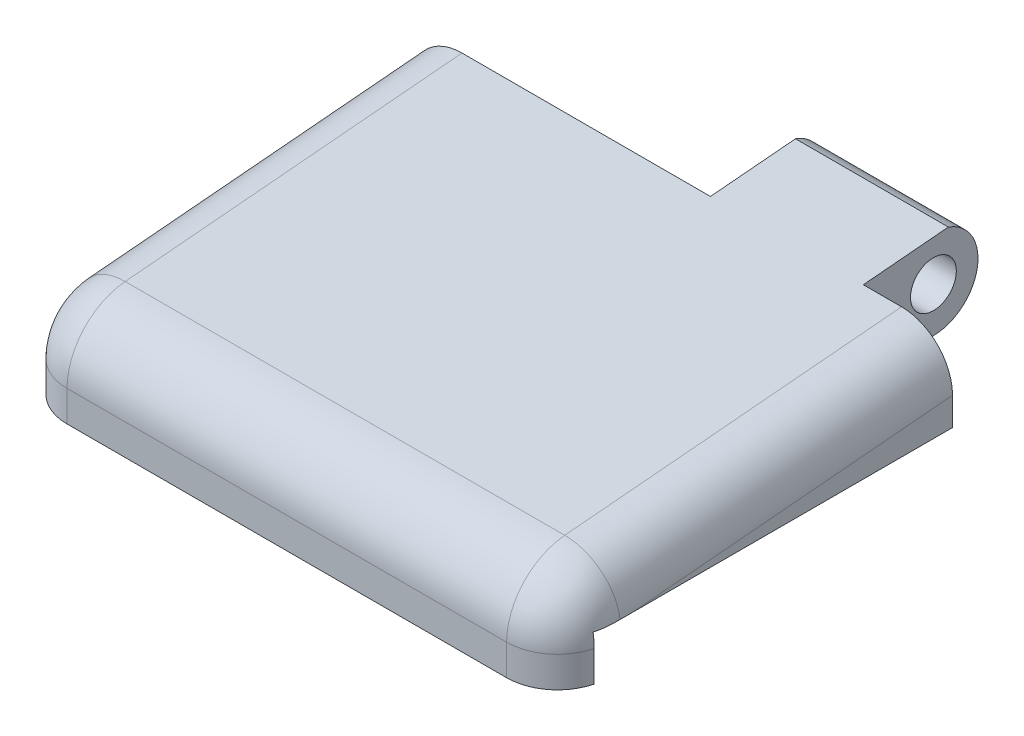
ISO-10303-21;
HEADER;
FILE_DESCRIPTION(('STEP AP214'),'2;1');
FILE_NAME('part.step','',(''),(''),'','','');
FILE_SCHEMA(('AUTOMOTIVE_DESIGN { 1 0 10303 214 1 1 1 1 }'));
ENDSEC;
DATA;
#1=APPLICATION_CONTEXT('core data for automotive mechanical design processes');
#2=APPLICATION_PROTOCOL_DEFINITION('international standard','automotive_design',2000,#1);
#3=PRODUCT_CONTEXT('',#1,'mechanical');
#4=PRODUCT('Part','Part','',(#3));
#5=PRODUCT_RELATED_PRODUCT_CATEGORY('part','',(#4));
#6=PRODUCT_DEFINITION_FORMATION('','',#4);
#7=PRODUCT_DEFINITION_CONTEXT('part definition',#1,'design');
#8=PRODUCT_DEFINITION('design','',#6,#7);
#9=PRODUCT_DEFINITION_SHAPE('','',#8);
#10=(LENGTH_UNIT() NAMED_UNIT(*) SI_UNIT(.MILLI.,.METRE.));
#11=(NAMED_UNIT(*) PLANE_ANGLE_UNIT() SI_UNIT($,.RADIAN.));
#12=(NAMED_UNIT(*) SI_UNIT($,.STERADIAN.) SOLID_ANGLE_UNIT());
#13=UNCERTAINTY_MEASURE_WITH_UNIT(LENGTH_MEASURE(1.E-05),#10,'distance_accuracy_value','');
#14=(GEOMETRIC_REPRESENTATION_CONTEXT(3) GLOBAL_UNCERTAINTY_ASSIGNED_CONTEXT((#13)) GLOBAL_UNIT_ASSIGNED_CONTEXT((#10,
#11,#12)) REPRESENTATION_CONTEXT('',''));
#15=CARTESIAN_POINT('',(0.,0.,0.));
#16=DIRECTION('',(0.,0.,1.));
#17=DIRECTION('',(1.,0.,0.));
#18=AXIS2_PLACEMENT_3D('',#15,#16,#17);
#19=CARTESIAN_POINT('',(0.,0.,0.));
#20=DIRECTION('',(0.,-1.,0.));
#21=DIRECTION('',(0.,0.,-1.));
#22=AXIS2_PLACEMENT_3D('',#19,#20,#21);
#23=PLANE('',#22);
#24=DIRECTION('',(1.,0.,0.));
#25=VECTOR('',#24,1.);
#26=CARTESIAN_POINT('',(-18.8632246376812,0.,11.7160326086957));
#27=LINE('',#26,#25);
#28=CARTESIAN_POINT('',(-18.6550695361003,0.,11.7160326086957));
#29=VERTEX_POINT('',#28);
#30=CARTESIAN_POINT('',(23.428620260738,0.,11.7160326086957));
#31=VERTEX_POINT('',#30);
#32=EDGE_CURVE('E353',#29,#31,#27,.T.);
#33=ORIENTED_EDGE('',*,*,#32,.F.);
#34=CARTESIAN_POINT('',(-18.8623143311757,0.,9.81062556264592));
#35=CARTESIAN_POINT('',(-18.8622212720629,0.,9.85615641249188));
#36=CARTESIAN_POINT('',(-18.8620788523589,0.,9.90168713850057));
#37=CARTESIAN_POINT('',(-18.8615798443658,0.,9.99275023400727));
#38=CARTESIAN_POINT('',(-18.8612232424007,0.,10.0382826034246));
#39=CARTESIAN_POINT('',(-18.8596582465762,0.,10.1749408688543));
#40=CARTESIAN_POINT('',(-18.8579544669418,0.,10.2660633373014));
#41=CARTESIAN_POINT('',(-18.8520022643299,0.,10.4471469945741));
#42=CARTESIAN_POINT('',(-18.8477845150658,0.,10.537109039549));
#43=CARTESIAN_POINT('',(-18.8357464956938,0.,10.7167911956804));
#44=CARTESIAN_POINT('',(-18.8279265504596,0.,10.8065113279208));
#45=CARTESIAN_POINT('',(-18.8035019626792,0.,11.0246343076007));
#46=CARTESIAN_POINT('',(-18.7845509662702,0.,11.1527912263999));
#47=CARTESIAN_POINT('',(-18.7361772906335,0.,11.4071250639296));
#48=CARTESIAN_POINT('',(-18.7067553021801,0.,11.5333021126996));
#49=CARTESIAN_POINT('',(-18.6362631751471,0.,11.784627061321));
#50=CARTESIAN_POINT('',(-18.5950108878518,0.,11.9097246134625));
#51=CARTESIAN_POINT('',(-18.5244396704684,0.,12.0941096265706));
#52=CARTESIAN_POINT('',(-18.4994417229986,0.,12.1550790979152));
#53=CARTESIAN_POINT('',(-18.4465652663742,0.,12.2757633399427));
#54=CARTESIAN_POINT('',(-18.4186864481418,0.,12.3354779751703));
#55=CARTESIAN_POINT('',(-18.3893766079648,0.,12.3944945425097));
#56=B_SPLINE_CURVE_WITH_KNOTS('',3,(#34,#35,#36,#37,#38,#39,#40,#41,#42,#43,#44,#45,#46,#47,#48,
#49,#50,#51,#52,#53,#54,#55),.UNSPECIFIED.,.F.,.F.,(4,2,2,2,2,2,2,2,2,2,4),(0.,
0.136592530811276,0.273193784304992,0.546590036837258,0.816716886009464,1.08681937785008,
1.47506879685177,1.86329260767091,2.25784813489281,2.45546827625955,2.6531096416016),.UNSPECIFIED.);
#57=CARTESIAN_POINT('',(-18.8623143311757,0.,9.81062556264592));
#58=VERTEX_POINT('',#57);
#59=EDGE_CURVE('E276',#29,#58,#56,.F.);
#60=ORIENTED_EDGE('',*,*,#59,.T.);
#61=CARTESIAN_POINT('',(-14.8632246376812,0.,8.83154574534277));
#62=DIRECTION('',(0.,-1.,0.));
#63=DIRECTION('',(0.,0.,-1.));
#64=AXIS2_PLACEMENT_3D('',#61,#62,#63);
#65=ELLIPSE('',#64,45.8948529826757,4.);
#66=CARTESIAN_POINT('',(-18.8632246376812,0.,8.83154574534276));
#67=VERTEX_POINT('',#66);
#68=EDGE_CURVE('E166',#58,#67,#65,.T.);
#69=ORIENTED_EDGE('',*,*,#68,.T.);
#70=DIRECTION('',(0.,0.,1.));
#71=VECTOR('',#70,1.);
#72=CARTESIAN_POINT('',(-18.8632246376812,0.,-16.2839673913044));
#73=LINE('',#72,#71);
#74=CARTESIAN_POINT('',(-18.8632246376812,0.,-16.2839673913044));
#75=VERTEX_POINT('',#74);
#76=EDGE_CURVE('E151',#75,#67,#73,.T.);
#77=ORIENTED_EDGE('',*,*,#76,.F.);
#78=DIRECTION('',(-1.,0.,0.));
#79=VECTOR('',#78,1.);
#80=CARTESIAN_POINT('',(-18.8632246376812,0.,-16.2839673913044));
#81=LINE('',#80,#79);
#82=CARTESIAN_POINT('',(4.63677536231884,0.,-16.2839673913044));
#83=VERTEX_POINT('',#82);
#84=EDGE_CURVE('E164',#83,#75,#81,.T.);
#85=ORIENTED_EDGE('',*,*,#84,.F.);
#86=DIRECTION('',(0.,0.,1.));
#87=VECTOR('',#86,1.);
#88=CARTESIAN_POINT('',(4.63677536231884,0.,-25.2839673913043));
#89=LINE('',#88,#87);
#90=CARTESIAN_POINT('',(4.63677536231884,0.,-21.7839673913043));
#91=VERTEX_POINT('',#90);
#92=EDGE_CURVE('E188',#91,#83,#89,.T.);
#93=ORIENTED_EDGE('',*,*,#92,.F.);
#94=DIRECTION('',(-1.,0.,0.));
#95=VECTOR('',#94,1.);
#96=CARTESIAN_POINT('',(16.6367753623188,0.,-21.7839673913043));
#97=LINE('',#96,#95);
#98=CARTESIAN_POINT('',(16.6367753623188,0.,-21.7839673913043));
#99=VERTEX_POINT('',#98);
#100=EDGE_CURVE('E197',#91,#99,#97,.F.);
#101=ORIENTED_EDGE('',*,*,#100,.T.);
#102=DIRECTION('',(0.,0.,-1.));
#103=VECTOR('',#102,1.);
#104=CARTESIAN_POINT('',(16.6367753623188,0.,-16.2839673913044));
#105=LINE('',#104,#103);
#106=CARTESIAN_POINT('',(16.6367753623188,0.,-16.2839673913044));
#107=VERTEX_POINT('',#106);
#108=EDGE_CURVE('E185',#107,#99,#105,.T.);
#109=ORIENTED_EDGE('',*,*,#108,.F.);
#110=DIRECTION('',(-1.,0.,0.));
#111=VECTOR('',#110,1.);
#112=CARTESIAN_POINT('',(16.6367753623188,0.,-16.2839673913044));
#113=LINE('',#112,#111);
#114=CARTESIAN_POINT('',(23.6367753623188,0.,-16.2839673913044));
#115=VERTEX_POINT('',#114);
#116=EDGE_CURVE('E182',#115,#107,#113,.T.);
#117=ORIENTED_EDGE('',*,*,#116,.F.);
#118=DIRECTION('',(0.,0.,-1.));
#119=VECTOR('',#118,1.);
#120=CARTESIAN_POINT('',(23.6367753623188,0.,-16.2839673913044));
#121=LINE('',#120,#119);
#122=CARTESIAN_POINT('',(23.6367753623188,0.,8.83154574534272));
#123=VERTEX_POINT('',#122);
#124=EDGE_CURVE('E167',#123,#115,#121,.T.);
#125=ORIENTED_EDGE('',*,*,#124,.F.);
#126=CARTESIAN_POINT('',(19.6367753623188,0.,8.83154574534277));
#127=DIRECTION('',(0.,-1.,0.));
#128=DIRECTION('',(0.,0.,1.));
#129=AXIS2_PLACEMENT_3D('',#126,#127,#128);
#130=ELLIPSE('',#129,45.8948529826757,4.);
#131=CARTESIAN_POINT('',(23.6358650558134,0.,9.81062556264591));
#132=VERTEX_POINT('',#131);
#133=EDGE_CURVE('E389',#123,#132,#130,.T.);
#134=ORIENTED_EDGE('',*,*,#133,.T.);
#135=CARTESIAN_POINT('',(23.6358650558134,0.,9.81062556264591));
#136=CARTESIAN_POINT('',(23.6357719967006,0.,9.85615641249186));
#137=CARTESIAN_POINT('',(23.6356295769966,0.,9.90168713850055));
#138=CARTESIAN_POINT('',(23.6351305690035,0.,9.99275023400725));
#139=CARTESIAN_POINT('',(23.6347739670384,0.,10.0382826034245));
#140=CARTESIAN_POINT('',(23.6332089712139,0.,10.1749408688542));
#141=CARTESIAN_POINT('',(23.6315051915795,0.,10.2660633373014));
#142=CARTESIAN_POINT('',(23.6255529889675,0.,10.4471469945741));
#143=CARTESIAN_POINT('',(23.6213352397034,0.,10.537109039549));
#144=CARTESIAN_POINT('',(23.6092972203315,0.,10.7167911956804));
#145=CARTESIAN_POINT('',(23.6014772750972,0.,10.8065113279208));
#146=CARTESIAN_POINT('',(23.5770526873169,0.,11.0246343076007));
#147=CARTESIAN_POINT('',(23.5581016909079,0.,11.1527912263998));
#148=CARTESIAN_POINT('',(23.5097280152711,0.,11.4071250639296));
#149=CARTESIAN_POINT('',(23.4803060268178,0.,11.5333021126996));
#150=CARTESIAN_POINT('',(23.4098138997848,0.,11.784627061321));
#151=CARTESIAN_POINT('',(23.3685616124895,0.,11.9097246134625));
#152=CARTESIAN_POINT('',(23.2979903951061,0.,12.0941096265706));
#153=CARTESIAN_POINT('',(23.2729924476363,0.,12.1550790979152));
#154=CARTESIAN_POINT('',(23.2201159910119,0.,12.2757633399427));
#155=CARTESIAN_POINT('',(23.1922371727795,0.,12.3354779751703));
#156=CARTESIAN_POINT('',(23.1629273326025,0.,12.3944945425097));
#157=B_SPLINE_CURVE_WITH_KNOTS('',3,(#135,#136,#137,#138,#139,#140,#141,#142,#143,#144,#145,
#146,#147,#148,#149,#150,#151,#152,#153,#154,#155,#156),.UNSPECIFIED.,.F.,.F.,(4,2,2,2,2,2,2,2,
2,2,4),(0.,0.136592530811274,0.273193784304992,0.54659003683726,0.816716886009464,
1.08681937785008,1.47506879685177,1.86329260767091,2.25784813489281,2.45546827625956,
2.65310964160161),.UNSPECIFIED.);
#158=EDGE_CURVE('E258',#132,#31,#157,.T.);
#159=ORIENTED_EDGE('',*,*,#158,.T.);
#160=EDGE_LOOP('',(#33,#60,#69,#77,#85,#93,#101,#109,#117,#125,#134,#159));
#161=FACE_BOUND('',#160,.T.);
#162=ADVANCED_FACE('F33',(#161),#23,.T.);
#163=CARTESIAN_POINT('',(-18.8632246376812,7.,-16.2839673913044));
#164=DIRECTION('',(0.,0.,1.));
#165=DIRECTION('',(1.,0.,0.));
#166=AXIS2_PLACEMENT_3D('',#163,#164,#165);
#167=PLANE('',#166);
#168=DIRECTION('',(0.,-1.,0.));
#169=VECTOR('',#168,1.);
#170=CARTESIAN_POINT('',(-18.8632246376812,7.,-16.2839673913044));
#171=LINE('',#170,#169);
#172=CARTESIAN_POINT('',(-18.8632246376812,2.19732267809322,-16.2839673913044));
#173=VERTEX_POINT('',#172);
#174=EDGE_CURVE('E148',#173,#75,#171,.T.);
#175=ORIENTED_EDGE('',*,*,#174,.F.);
#176=CARTESIAN_POINT('',(-14.8632246376812,2.19732267809323,-16.2839673913044));
#177=DIRECTION('',(0.,0.,1.));
#178=DIRECTION('',(0.,1.,0.));
#179=AXIS2_PLACEMENT_3D('',#176,#177,#178);
#180=ELLIPSE('',#179,4.01527935017339,4.);
#181=CARTESIAN_POINT('',(-14.8632246376812,6.21260202826662,-16.2839673913044));
#182=VERTEX_POINT('',#181);
#183=EDGE_CURVE('E330',#173,#182,#180,.F.);
#184=ORIENTED_EDGE('',*,*,#183,.T.);
#185=DIRECTION('',(-1.,0.,0.));
#186=VECTOR('',#185,1.);
#187=CARTESIAN_POINT('',(0.,6.21260202826662,-16.2839673913044));
#188=LINE('',#187,#186);
#189=CARTESIAN_POINT('',(4.63677536231884,6.21260202826662,-16.2839673913044));
#190=VERTEX_POINT('',#189);
#191=EDGE_CURVE('E216',#182,#190,#188,.F.);
#192=ORIENTED_EDGE('',*,*,#191,.T.);
#193=DIRECTION('',(0.,-1.,0.));
#194=VECTOR('',#193,1.);
#195=CARTESIAN_POINT('',(4.63677536231884,7.,-16.2839673913044));
#196=LINE('',#195,#194);
#197=EDGE_CURVE('E171',#190,#83,#196,.T.);
#198=ORIENTED_EDGE('',*,*,#197,.T.);
#199=ORIENTED_EDGE('',*,*,#84,.T.);
#200=EDGE_LOOP('',(#175,#184,#192,#198,#199));
#201=FACE_BOUND('',#200,.T.);
#202=ADVANCED_FACE('F169',(#201),#167,.F.);
#203=CARTESIAN_POINT('',(-18.8632246376812,7.,-16.2839673913044));
#204=DIRECTION('',(1.,0.,0.));
#205=DIRECTION('',(0.,0.,-1.));
#206=AXIS2_PLACEMENT_3D('',#203,#204,#205);
#207=PLANE('',#206);
#208=ORIENTED_EDGE('',*,*,#76,.T.);
#209=DIRECTION('',(0.,-0.0871557427476653,0.996194698091745));
#210=VECTOR('',#209,1.);
#211=CARTESIAN_POINT('',(-18.8632246376812,2.22782323589964,-16.632590362295));
#212=LINE('',#211,#210);
#213=EDGE_CURVE('E153',#67,#173,#212,.F.);
#214=ORIENTED_EDGE('',*,*,#213,.T.);
#215=ORIENTED_EDGE('',*,*,#174,.T.);
#216=EDGE_LOOP('',(#208,#214,#215));
#217=FACE_BOUND('',#216,.T.);
#218=ADVANCED_FACE('F150',(#217),#207,.F.);
#219=CARTESIAN_POINT('',(-18.8632246376812,7.,14.7160326086957));
#220=DIRECTION('',(0.,0.,-1.));
#221=DIRECTION('',(-1.,0.,0.));
#222=AXIS2_PLACEMENT_3D('',#219,#220,#221);
#223=PLANE('',#222);
#224=DIRECTION('',(1.,0.,0.));
#225=VECTOR('',#224,1.);
#226=CARTESIAN_POINT('',(-18.8632246376812,-1.08120241112434,14.7160326086957));
#227=LINE('',#226,#225);
#228=CARTESIAN_POINT('',(19.6367753623188,-1.08120241112434,14.7160326086957));
#229=VERTEX_POINT('',#228);
#230=CARTESIAN_POINT('',(-14.8632246376812,-1.08120241112434,14.7160326086957));
#231=VERTEX_POINT('',#230);
#232=EDGE_CURVE('E220',#229,#231,#227,.F.);
#233=ORIENTED_EDGE('',*,*,#232,.T.);
#234=DIRECTION('',(0.,-1.,0.));
#235=VECTOR('',#234,1.);
#236=CARTESIAN_POINT('',(-14.8632246376812,7.,14.7160326086957));
#237=LINE('',#236,#235);
#238=CARTESIAN_POINT('',(-14.8632246376812,-3.5,14.7160326086957));
#239=VERTEX_POINT('',#238);
#240=EDGE_CURVE('E50',#231,#239,#237,.T.);
#241=ORIENTED_EDGE('',*,*,#240,.T.);
#242=DIRECTION('',(-1.,0.,0.));
#243=VECTOR('',#242,1.);
#244=CARTESIAN_POINT('',(-18.8632246376812,-3.5,14.7160326086957));
#245=LINE('',#244,#243);
#246=CARTESIAN_POINT('',(19.6367753623188,-3.5,14.7160326086957));
#247=VERTEX_POINT('',#246);
#248=EDGE_CURVE('E209',#247,#239,#245,.T.);
#249=ORIENTED_EDGE('',*,*,#248,.F.);
#250=DIRECTION('',(0.,-1.,0.));
#251=VECTOR('',#250,1.);
#252=CARTESIAN_POINT('',(19.6367753623188,7.,14.7160326086957));
#253=LINE('',#252,#251);
#254=EDGE_CURVE('E346',#247,#229,#253,.F.);
#255=ORIENTED_EDGE('',*,*,#254,.T.);
#256=EDGE_LOOP('',(#233,#241,#249,#255));
#257=FACE_BOUND('',#256,.T.);
#258=ADVANCED_FACE('F303',(#257),#223,.F.);
#259=CARTESIAN_POINT('',(23.6367753623188,7.,-16.2839673913044));
#260=DIRECTION('',(-1.,0.,0.));
#261=DIRECTION('',(0.,0.,1.));
#262=AXIS2_PLACEMENT_3D('',#259,#260,#261);
#263=PLANE('',#262);
#264=DIRECTION('',(0.,-1.,0.));
#265=VECTOR('',#264,1.);
#266=CARTESIAN_POINT('',(23.6367753623188,7.,-16.2839673913044));
#267=LINE('',#266,#265);
#268=CARTESIAN_POINT('',(23.6367753623188,2.19732267809322,-16.2839673913044));
#269=VERTEX_POINT('',#268);
#270=EDGE_CURVE('E158',#269,#115,#267,.T.);
#271=ORIENTED_EDGE('',*,*,#270,.F.);
#272=DIRECTION('',(0.,0.0871557427476653,-0.996194698091745));
#273=VECTOR('',#272,1.);
#274=CARTESIAN_POINT('',(23.6367753623188,-0.0850077130325898,9.80318835144331));
#275=LINE('',#274,#273);
#276=EDGE_CURVE('E341',#269,#123,#275,.F.);
#277=ORIENTED_EDGE('',*,*,#276,.T.);
#278=ORIENTED_EDGE('',*,*,#124,.T.);
#279=EDGE_LOOP('',(#271,#277,#278));
#280=FACE_BOUND('',#279,.T.);
#281=ADVANCED_FACE('F299',(#280),#263,.F.);
#282=CARTESIAN_POINT('',(16.6367753623188,7.,-16.2839673913044));
#283=DIRECTION('',(0.,0.,1.));
#284=DIRECTION('',(1.,0.,0.));
#285=AXIS2_PLACEMENT_3D('',#282,#283,#284);
#286=PLANE('',#285);
#287=DIRECTION('',(-1.,0.,0.));
#288=VECTOR('',#287,1.);
#289=CARTESIAN_POINT('',(0.,6.21260202826662,-16.2839673913044));
#290=LINE('',#289,#288);
#291=CARTESIAN_POINT('',(16.6367753623188,6.21260202826662,-16.2839673913044));
#292=VERTEX_POINT('',#291);
#293=CARTESIAN_POINT('',(19.6367753623188,6.21260202826662,-16.2839673913044));
#294=VERTEX_POINT('',#293);
#295=EDGE_CURVE('E213',#292,#294,#290,.F.);
#296=ORIENTED_EDGE('',*,*,#295,.T.);
#297=CARTESIAN_POINT('',(19.6367753623188,2.19732267809323,-16.2839673913044));
#298=DIRECTION('',(0.,0.,1.));
#299=DIRECTION('',(0.,-1.,0.));
#300=AXIS2_PLACEMENT_3D('',#297,#298,#299);
#301=ELLIPSE('',#300,4.01527935017339,4.);
#302=EDGE_CURVE('E344',#294,#269,#301,.F.);
#303=ORIENTED_EDGE('',*,*,#302,.T.);
#304=ORIENTED_EDGE('',*,*,#270,.T.);
#305=ORIENTED_EDGE('',*,*,#116,.T.);
#306=DIRECTION('',(0.,-1.,0.));
#307=VECTOR('',#306,1.);
#308=CARTESIAN_POINT('',(16.6367753623188,7.,-16.2839673913044));
#309=LINE('',#308,#307);
#310=EDGE_CURVE('E191',#292,#107,#309,.T.);
#311=ORIENTED_EDGE('',*,*,#310,.F.);
#312=EDGE_LOOP('',(#296,#303,#304,#305,#311));
#313=FACE_BOUND('',#312,.T.);
#314=ADVANCED_FACE('F295',(#313),#286,.F.);
#315=CARTESIAN_POINT('',(16.6367753623188,7.,-16.2839673913044));
#316=DIRECTION('',(-1.,0.,0.));
#317=DIRECTION('',(0.,0.,1.));
#318=AXIS2_PLACEMENT_3D('',#315,#316,#317);
#319=PLANE('',#318);
#320=CARTESIAN_POINT('',(16.6367753623188,3.5,-21.7839673913043));
#321=DIRECTION('',(1.,0.,0.));
#322=DIRECTION('',(0.,0.,-1.));
#323=AXIS2_PLACEMENT_3D('',#320,#321,#322);
#324=CIRCLE('',#323,1.8);
#325=CARTESIAN_POINT('',(16.6367753623188,3.5,-23.5839673913043));
#326=VERTEX_POINT('',#325);
#327=EDGE_CURVE('E176',#326,#326,#324,.T.);
#328=ORIENTED_EDGE('',*,*,#327,.F.);
#329=EDGE_LOOP('',(#328));
#330=FACE_BOUND('',#329,.T.);
#331=CARTESIAN_POINT('',(16.6367753623188,3.5,-21.7839673913043));
#332=DIRECTION('',(-1.,0.,0.));
#333=DIRECTION('',(0.,0.,1.));
#334=AXIS2_PLACEMENT_3D('',#331,#332,#333);
#335=CIRCLE('',#334,3.5);
#336=CARTESIAN_POINT('',(16.6367753623188,3.5,-25.2839673913043));
#337=VERTEX_POINT('',#336);
#338=CARTESIAN_POINT('',(16.6367753623188,6.79664494933587,-22.9596085261828));
#339=VERTEX_POINT('',#338);
#340=EDGE_CURVE('E200',#337,#339,#335,.F.);
#341=ORIENTED_EDGE('',*,*,#340,.T.);
#342=DIRECTION('',(0.,0.0871557427476653,-0.996194698091745));
#343=VECTOR('',#342,1.);
#344=CARTESIAN_POINT('',(16.6367753623188,7.,-25.2839673913044));
#345=LINE('',#344,#343);
#346=EDGE_CURVE('E211',#339,#292,#345,.F.);
#347=ORIENTED_EDGE('',*,*,#346,.T.);
#348=ORIENTED_EDGE('',*,*,#310,.T.);
#349=ORIENTED_EDGE('',*,*,#108,.T.);
#350=CARTESIAN_POINT('',(16.6367753623188,3.5,-21.7839673913043));
#351=DIRECTION('',(-1.,0.,0.));
#352=DIRECTION('',(0.,0.,1.));
#353=AXIS2_PLACEMENT_3D('',#350,#351,#352);
#354=CIRCLE('',#353,3.5);
#355=EDGE_CURVE('E203',#99,#337,#354,.F.);
#356=ORIENTED_EDGE('',*,*,#355,.T.);
#357=EDGE_LOOP('',(#341,#347,#348,#349,#356));
#358=FACE_BOUND('',#357,.T.);
#359=ADVANCED_FACE('F291',(#330,#358),#319,.F.);
#360=CARTESIAN_POINT('',(4.63677536231884,7.,-25.2839673913043));
#361=DIRECTION('',(1.,0.,0.));
#362=DIRECTION('',(0.,0.,-1.));
#363=AXIS2_PLACEMENT_3D('',#360,#361,#362);
#364=PLANE('',#363);
#365=CARTESIAN_POINT('',(4.63677536231884,3.5,-21.7839673913043));
#366=DIRECTION('',(1.,0.,0.));
#367=DIRECTION('',(0.,0.,-1.));
#368=AXIS2_PLACEMENT_3D('',#365,#366,#367);
#369=CIRCLE('',#368,1.8);
#370=CARTESIAN_POINT('',(4.63677536231884,3.5,-23.5839673913043));
#371=VERTEX_POINT('',#370);
#372=EDGE_CURVE('E173',#371,#371,#369,.F.);
#373=ORIENTED_EDGE('',*,*,#372,.F.);
#374=EDGE_LOOP('',(#373));
#375=FACE_BOUND('',#374,.T.);
#376=ORIENTED_EDGE('',*,*,#197,.F.);
#377=DIRECTION('',(0.,-0.0871557427476653,0.996194698091745));
#378=VECTOR('',#377,1.);
#379=CARTESIAN_POINT('',(4.63677536231884,7.,-25.2839673913044));
#380=LINE('',#379,#378);
#381=CARTESIAN_POINT('',(4.63677536231884,6.79664494933587,-22.9596085261828));
#382=VERTEX_POINT('',#381);
#383=EDGE_CURVE('E218',#190,#382,#380,.F.);
#384=ORIENTED_EDGE('',*,*,#383,.T.);
#385=CARTESIAN_POINT('',(4.63677536231884,3.5,-21.7839673913043));
#386=DIRECTION('',(1.,0.,0.));
#387=DIRECTION('',(0.,0.,-1.));
#388=AXIS2_PLACEMENT_3D('',#385,#386,#387);
#389=CIRCLE('',#388,3.5);
#390=CARTESIAN_POINT('',(4.63677536231884,3.5,-25.2839673913043));
#391=VERTEX_POINT('',#390);
#392=EDGE_CURVE('E157',#382,#391,#389,.F.);
#393=ORIENTED_EDGE('',*,*,#392,.T.);
#394=CARTESIAN_POINT('',(4.63677536231884,3.5,-21.7839673913043));
#395=DIRECTION('',(1.,0.,0.));
#396=DIRECTION('',(0.,0.,-1.));
#397=AXIS2_PLACEMENT_3D('',#394,#395,#396);
#398=CIRCLE('',#397,3.5);
#399=EDGE_CURVE('E195',#391,#91,#398,.F.);
#400=ORIENTED_EDGE('',*,*,#399,.T.);
#401=ORIENTED_EDGE('',*,*,#92,.T.);
#402=EDGE_LOOP('',(#376,#384,#393,#400,#401));
#403=FACE_BOUND('',#402,.T.);
#404=ADVANCED_FACE('F287',(#375,#403),#364,.F.);
#405=CARTESIAN_POINT('',(-0.454393462224301,3.5,-21.7839673913043));
#406=DIRECTION('',(1.,0.,0.));
#407=DIRECTION('',(0.,0.,-1.));
#408=AXIS2_PLACEMENT_3D('',#405,#406,#407);
#409=CYLINDRICAL_SURFACE('',#408,1.8);
#410=ORIENTED_EDGE('',*,*,#372,.T.);
#411=EDGE_LOOP('',(#410));
#412=FACE_BOUND('',#411,.T.);
#413=ORIENTED_EDGE('',*,*,#327,.T.);
#414=EDGE_LOOP('',(#413));
#415=FACE_BOUND('',#414,.T.);
#416=ADVANCED_FACE('F247',(#412,#415),#409,.F.);
#417=CARTESIAN_POINT('',(0.,3.5,-21.7839673913043));
#418=DIRECTION('',(-1.,0.,0.));
#419=DIRECTION('',(0.,0.,1.));
#420=AXIS2_PLACEMENT_3D('',#417,#418,#419);
#421=CYLINDRICAL_SURFACE('',#420,3.5);
#422=ORIENTED_EDGE('',*,*,#392,.F.);
#423=DIRECTION('',(-1.,0.,0.));
#424=VECTOR('',#423,1.);
#425=CARTESIAN_POINT('',(10.6367753623188,6.79664494933587,-22.9596085261828));
#426=LINE('',#425,#424);
#427=EDGE_CURVE('E205',#382,#339,#426,.F.);
#428=ORIENTED_EDGE('',*,*,#427,.T.);
#429=ORIENTED_EDGE('',*,*,#340,.F.);
#430=DIRECTION('',(-1.,0.,0.));
#431=VECTOR('',#430,1.);
#432=CARTESIAN_POINT('',(16.6367753623188,3.5,-25.2839673913043));
#433=LINE('',#432,#431);
#434=EDGE_CURVE('E206',#391,#337,#433,.F.);
#435=ORIENTED_EDGE('',*,*,#434,.F.);
#436=EDGE_LOOP('',(#422,#428,#429,#435));
#437=FACE_BOUND('',#436,.T.);
#438=ADVANCED_FACE('F314',(#437),#421,.T.);
#439=CARTESIAN_POINT('',(16.6367753623188,3.5,-21.7839673913043));
#440=DIRECTION('',(1.,0.,0.));
#441=DIRECTION('',(0.,0.,-1.));
#442=AXIS2_PLACEMENT_3D('',#439,#440,#441);
#443=CYLINDRICAL_SURFACE('',#442,3.5);
#444=ORIENTED_EDGE('',*,*,#355,.F.);
#445=ORIENTED_EDGE('',*,*,#100,.F.);
#446=ORIENTED_EDGE('',*,*,#399,.F.);
#447=ORIENTED_EDGE('',*,*,#434,.T.);
#448=EDGE_LOOP('',(#444,#445,#446,#447));
#449=FACE_BOUND('',#448,.T.);
#450=ADVANCED_FACE('F311',(#449),#443,.T.);
#451=CARTESIAN_POINT('',(0.,7.,-25.2839673913044));
#452=DIRECTION('',(0.,-0.996194698091745,-0.0871557427476653));
#453=DIRECTION('',(1.,0.,0.));
#454=AXIS2_PLACEMENT_3D('',#451,#452,#453);
#455=PLANE('',#454);
#456=ORIENTED_EDGE('',*,*,#191,.F.);
#457=DIRECTION('',(0.,0.0871557427476653,-0.996194698091745));
#458=VECTOR('',#457,1.);
#459=CARTESIAN_POINT('',(-14.8632246376812,3.89977107933439,10.151811322434));
#460=LINE('',#459,#458);
#461=CARTESIAN_POINT('',(-14.8632246376812,3.89977107933439,10.151811322434));
#462=VERTEX_POINT('',#461);
#463=EDGE_CURVE('E325',#182,#462,#460,.F.);
#464=ORIENTED_EDGE('',*,*,#463,.T.);
#465=DIRECTION('',(-1.,0.,0.));
#466=VECTOR('',#465,1.);
#467=CARTESIAN_POINT('',(23.6367753623188,3.89977107933439,10.151811322434));
#468=LINE('',#467,#466);
#469=CARTESIAN_POINT('',(19.6367753623188,3.89977107933439,10.151811322434));
#470=VERTEX_POINT('',#469);
#471=EDGE_CURVE('E222',#462,#470,#468,.F.);
#472=ORIENTED_EDGE('',*,*,#471,.T.);
#473=DIRECTION('',(0.,-0.0871557427476653,0.996194698091745));
#474=VECTOR('',#473,1.);
#475=CARTESIAN_POINT('',(19.6367753623188,6.21260202826662,-16.2839673913044));
#476=LINE('',#475,#474);
#477=EDGE_CURVE('E334',#470,#294,#476,.F.);
#478=ORIENTED_EDGE('',*,*,#477,.T.);
#479=ORIENTED_EDGE('',*,*,#295,.F.);
#480=ORIENTED_EDGE('',*,*,#346,.F.);
#481=ORIENTED_EDGE('',*,*,#427,.F.);
#482=ORIENTED_EDGE('',*,*,#383,.F.);
#483=EDGE_LOOP('',(#456,#464,#472,#478,#479,#480,#481,#482));
#484=FACE_BOUND('',#483,.T.);
#485=ADVANCED_FACE('F245',(#484),#455,.F.);
#486=CARTESIAN_POINT('',(-18.8632246376812,-3.5,11.7160326086957));
#487=DIRECTION('',(0.,0.,1.));
#488=DIRECTION('',(1.,0.,0.));
#489=AXIS2_PLACEMENT_3D('',#486,#487,#488);
#490=PLANE('',#489);
#491=DIRECTION('',(0.,-1.,0.));
#492=VECTOR('',#491,1.);
#493=CARTESIAN_POINT('',(-18.7362079838886,7.,11.7160326086957));
#494=LINE('',#493,#492);
#495=CARTESIAN_POINT('',(-18.7362079838886,-3.5,11.7160326086957));
#496=VERTEX_POINT('',#495);
#497=CARTESIAN_POINT('',(-18.7362079838886,-1.08120241112434,11.7160326086957));
#498=VERTEX_POINT('',#497);
#499=EDGE_CURVE('E234',#496,#498,#494,.F.);
#500=ORIENTED_EDGE('',*,*,#499,.T.);
#501=CARTESIAN_POINT('',(-18.6550695361003,0.,11.7160326086957));
#502=CARTESIAN_POINT('',(-18.6704331192507,-0.0962520591327507,11.7160326086957));
#503=CARTESIAN_POINT('',(-18.6833616740046,-0.192868642369853,11.7160326086957));
#504=CARTESIAN_POINT('',(-18.7047800401528,-0.386554709642636,11.7160326086957));
#505=CARTESIAN_POINT('',(-18.713271726511,-0.483623984851359,11.7160326086957));
#506=CARTESIAN_POINT('',(-18.7262175333451,-0.677386589734707,11.7160326086957));
#507=CARTESIAN_POINT('',(-18.7306976491903,-0.774078236993188,11.7160326086957));
#508=CARTESIAN_POINT('',(-18.7359869234096,-0.96757949664846,11.7160326086957));
#509=CARTESIAN_POINT('',(-18.73679535988,-1.06438912850036,11.7160326086957));
#510=CARTESIAN_POINT('',(-18.734794112469,-1.25800454106717,11.7160326086957));
#511=CARTESIAN_POINT('',(-18.7319832071572,-1.35481030945085,11.7160326086957));
#512=CARTESIAN_POINT('',(-18.7225594423474,-1.54821809414566,11.7160326086957));
#513=CARTESIAN_POINT('',(-18.7159474254708,-1.64482015085318,11.7160326086957));
#514=CARTESIAN_POINT('',(-18.6984998375585,-1.83829018088646,11.7160326086957));
#515=CARTESIAN_POINT('',(-18.6876368753127,-1.93515574893393,11.7160326086957));
#516=CARTESIAN_POINT('',(-18.6612195153075,-2.12829570219212,11.7160326086957));
#517=CARTESIAN_POINT('',(-18.6456625189336,-2.22456972972604,11.7160326086957));
#518=CARTESIAN_POINT('',(-18.627529107008,-2.32038378714686,11.7160326086957));
#519=B_SPLINE_CURVE_WITH_KNOTS('',3,(#501,#502,#503,#504,#505,#506,#507,#508,#509,#510,#511,
#512,#513,#514,#515,#516,#517,#518),.UNSPECIFIED.,.F.,.F.,(4,2,2,2,2,2,2,2,4),(0.,
0.292345692325822,0.584567742978317,0.874882167299401,1.16525366904641,1.45572318904156,
1.74612834325252,2.03843639549149,2.33090656712731),.UNSPECIFIED.);
#520=EDGE_CURVE('E250',#498,#29,#519,.F.);
#521=ORIENTED_EDGE('',*,*,#520,.T.);
#522=ORIENTED_EDGE('',*,*,#32,.T.);
#523=CARTESIAN_POINT('',(23.428620260738,0.,11.7160326086957));
#524=CARTESIAN_POINT('',(23.4439838438884,-0.0962520591327507,11.7160326086957));
#525=CARTESIAN_POINT('',(23.4569123986423,-0.192868642369853,11.7160326086957));
#526=CARTESIAN_POINT('',(23.4783307647905,-0.386554709642636,11.7160326086957));
#527=CARTESIAN_POINT('',(23.4868224511487,-0.483623984851359,11.7160326086957));
#528=CARTESIAN_POINT('',(23.4997682579828,-0.677386589734707,11.7160326086957));
#529=CARTESIAN_POINT('',(23.5042483738279,-0.774078236993188,11.7160326086957));
#530=CARTESIAN_POINT('',(23.5095376480473,-0.967579496648459,11.7160326086957));
#531=CARTESIAN_POINT('',(23.5103460845177,-1.06438912850036,11.7160326086957));
#532=CARTESIAN_POINT('',(23.5083448371067,-1.25800454106717,11.7160326086957));
#533=CARTESIAN_POINT('',(23.5055339317949,-1.35481030945085,11.7160326086957));
#534=CARTESIAN_POINT('',(23.4961101669851,-1.54821809414566,11.7160326086957));
#535=CARTESIAN_POINT('',(23.4894981501085,-1.64482015085318,11.7160326086957));
#536=CARTESIAN_POINT('',(23.4720505621961,-1.83829018088646,11.7160326086957));
#537=CARTESIAN_POINT('',(23.4611875999503,-1.93515574893393,11.7160326086957));
#538=CARTESIAN_POINT('',(23.4347702399452,-2.12829570219212,11.7160326086957));
#539=CARTESIAN_POINT('',(23.4192132435712,-2.22456972972604,11.7160326086957));
#540=CARTESIAN_POINT('',(23.4010798316456,-2.32038378714686,11.7160326086957));
#541=B_SPLINE_CURVE_WITH_KNOTS('',3,(#523,#524,#525,#526,#527,#528,#529,#530,#531,#532,#533,
#534,#535,#536,#537,#538,#539,#540),.UNSPECIFIED.,.F.,.F.,(4,2,2,2,2,2,2,2,4),(0.,
0.292345692325822,0.584567742978317,0.874882167299401,1.16525366904641,1.45572318904156,
1.74612834325252,2.03843639549149,2.33090656712731),.UNSPECIFIED.);
#542=CARTESIAN_POINT('',(23.5097587085263,-1.08120241112434,11.7160326086957));
#543=VERTEX_POINT('',#542);
#544=EDGE_CURVE('E227',#31,#543,#541,.T.);
#545=ORIENTED_EDGE('',*,*,#544,.T.);
#546=DIRECTION('',(0.,-1.,0.));
#547=VECTOR('',#546,1.);
#548=CARTESIAN_POINT('',(23.5097587085263,7.,11.7160326086957));
#549=LINE('',#548,#547);
#550=CARTESIAN_POINT('',(23.5097587085263,-3.5,11.7160326086957));
#551=VERTEX_POINT('',#550);
#552=EDGE_CURVE('E225',#543,#551,#549,.T.);
#553=ORIENTED_EDGE('',*,*,#552,.T.);
#554=DIRECTION('',(1.,0.,0.));
#555=VECTOR('',#554,1.);
#556=CARTESIAN_POINT('',(-18.8632246376812,-3.5,11.7160326086957));
#557=LINE('',#556,#555);
#558=EDGE_CURVE('E369',#496,#551,#557,.T.);
#559=ORIENTED_EDGE('',*,*,#558,.F.);
#560=EDGE_LOOP('',(#500,#521,#522,#545,#553,#559));
#561=FACE_BOUND('',#560,.T.);
#562=ADVANCED_FACE('F239',(#561),#490,.F.);
#563=CARTESIAN_POINT('',(0.,-3.5,0.));
#564=DIRECTION('',(0.,-1.,0.));
#565=DIRECTION('',(0.,0.,-1.));
#566=AXIS2_PLACEMENT_3D('',#563,#564,#565);
#567=PLANE('',#566);
#568=ORIENTED_EDGE('',*,*,#248,.T.);
#569=CARTESIAN_POINT('',(-14.8632246376812,-3.5,10.7160326086957));
#570=DIRECTION('',(0.,-1.,0.));
#571=DIRECTION('',(0.,0.,-1.));
#572=AXIS2_PLACEMENT_3D('',#569,#570,#571);
#573=CIRCLE('',#572,4.);
#574=EDGE_CURVE('E11',#239,#496,#573,.T.);
#575=ORIENTED_EDGE('',*,*,#574,.T.);
#576=ORIENTED_EDGE('',*,*,#558,.T.);
#577=CARTESIAN_POINT('',(19.6367753623188,-3.5,10.7160326086957));
#578=DIRECTION('',(0.,-1.,0.));
#579=DIRECTION('',(0.,0.,-1.));
#580=AXIS2_PLACEMENT_3D('',#577,#578,#579);
#581=CIRCLE('',#580,4.);
#582=EDGE_CURVE('E42',#551,#247,#581,.T.);
#583=ORIENTED_EDGE('',*,*,#582,.T.);
#584=EDGE_LOOP('',(#568,#575,#576,#583));
#585=FACE_BOUND('',#584,.T.);
#586=ADVANCED_FACE('F244',(#585),#567,.T.);
#587=CARTESIAN_POINT('',(-18.8632246376812,-1.08120241112434,9.71603260869566));
#588=DIRECTION('',(-1.,0.,0.));
#589=DIRECTION('',(0.,0.,1.));
#590=AXIS2_PLACEMENT_3D('',#587,#588,#589);
#591=CYLINDRICAL_SURFACE('',#590,5.);
#592=ORIENTED_EDGE('',*,*,#471,.F.);
#593=CARTESIAN_POINT('',(-14.8632246376812,-1.08120241112434,9.71603260869566));
#594=DIRECTION('',(1.,0.,0.));
#595=DIRECTION('',(0.,0.,-1.));
#596=AXIS2_PLACEMENT_3D('',#593,#594,#595);
#597=CIRCLE('',#596,5.);
#598=EDGE_CURVE('E336',#462,#231,#597,.T.);
#599=ORIENTED_EDGE('',*,*,#598,.T.);
#600=ORIENTED_EDGE('',*,*,#232,.F.);
#601=CARTESIAN_POINT('',(19.6367753623188,-1.08120241112434,9.71603260869566));
#602=DIRECTION('',(-1.,0.,0.));
#603=DIRECTION('',(0.,0.,1.));
#604=AXIS2_PLACEMENT_3D('',#601,#602,#603);
#605=CIRCLE('',#604,5.);
#606=EDGE_CURVE('E333',#229,#470,#605,.T.);
#607=ORIENTED_EDGE('',*,*,#606,.T.);
#608=EDGE_LOOP('',(#592,#599,#600,#607));
#609=FACE_BOUND('',#608,.T.);
#610=ADVANCED_FACE('F271',(#609),#591,.T.);
#611=CARTESIAN_POINT('',(-14.8632246376812,7.,10.7160326086957));
#612=DIRECTION('',(0.,-1.,0.));
#613=DIRECTION('',(0.,0.,-1.));
#614=AXIS2_PLACEMENT_3D('',#611,#612,#613);
#615=CYLINDRICAL_SURFACE('',#614,4.);
#616=ORIENTED_EDGE('',*,*,#574,.F.);
#617=ORIENTED_EDGE('',*,*,#240,.F.);
#618=CARTESIAN_POINT('',(-14.8632246376812,-1.08120241112434,10.7160326086957));
#619=DIRECTION('',(0.,1.,0.));
#620=DIRECTION('',(0.,0.,1.));
#621=AXIS2_PLACEMENT_3D('',#618,#619,#620);
#622=CIRCLE('',#621,4.);
#623=EDGE_CURVE('E351',#498,#231,#622,.T.);
#624=ORIENTED_EDGE('',*,*,#623,.F.);
#625=ORIENTED_EDGE('',*,*,#499,.F.);
#626=EDGE_LOOP('',(#616,#617,#624,#625));
#627=FACE_BOUND('',#626,.T.);
#628=ADVANCED_FACE('F403',(#627),#615,.T.);
#629=CARTESIAN_POINT('',(-14.8632246376812,2.23380440813177,-16.7009554737401));
#630=DIRECTION('',(0.,0.0871557427476653,-0.996194698091745));
#631=DIRECTION('',(0.,0.996194698091745,0.0871557427476653));
#632=AXIS2_PLACEMENT_3D('',#629,#630,#631);
#633=CYLINDRICAL_SURFACE('',#632,4.);
#634=ORIENTED_EDGE('',*,*,#213,.F.);
#635=ORIENTED_EDGE('',*,*,#68,.F.);
#636=CARTESIAN_POINT('',(-14.8632246376812,-0.0850077130325915,9.80318835144332));
#637=DIRECTION('',(0.,-0.0871557427476652,0.996194698091745));
#638=DIRECTION('',(0.,-0.996194698091745,-0.0871557427476652));
#639=AXIS2_PLACEMENT_3D('',#636,#637,#638);
#640=CIRCLE('',#639,4.);
#641=EDGE_CURVE('E332',#462,#58,#640,.T.);
#642=ORIENTED_EDGE('',*,*,#641,.F.);
#643=ORIENTED_EDGE('',*,*,#463,.F.);
#644=ORIENTED_EDGE('',*,*,#183,.F.);
#645=EDGE_LOOP('',(#634,#635,#642,#643,#644));
#646=FACE_BOUND('',#645,.T.);
#647=ADVANCED_FACE('F269',(#646),#633,.T.);
#648=CARTESIAN_POINT('',(-14.8632246376812,-1.08120241112434,9.71603260869566));
#649=DIRECTION('',(1.,0.,0.));
#650=DIRECTION('',(0.,0.,-1.));
#651=AXIS2_PLACEMENT_3D('',#648,#649,#650);
#652=DEGENERATE_TOROIDAL_SURFACE('',#651,1.,4.,.T.);
#653=ORIENTED_EDGE('',*,*,#623,.T.);
#654=ORIENTED_EDGE('',*,*,#598,.F.);
#655=ORIENTED_EDGE('',*,*,#641,.T.);
#656=ORIENTED_EDGE('',*,*,#59,.F.);
#657=ORIENTED_EDGE('',*,*,#520,.F.);
#658=EDGE_LOOP('',(#653,#654,#655,#656,#657));
#659=FACE_BOUND('',#658,.T.);
#660=ADVANCED_FACE('F264',(#659),#652,.T.);
#661=CARTESIAN_POINT('',(19.6367753623188,7.,10.7160326086957));
#662=DIRECTION('',(0.,-1.,0.));
#663=DIRECTION('',(0.,0.,-1.));
#664=AXIS2_PLACEMENT_3D('',#661,#662,#663);
#665=CYLINDRICAL_SURFACE('',#664,4.);
#666=ORIENTED_EDGE('',*,*,#582,.F.);
#667=ORIENTED_EDGE('',*,*,#552,.F.);
#668=CARTESIAN_POINT('',(19.6367753623188,-1.08120241112434,10.7160326086957));
#669=DIRECTION('',(0.,1.,0.));
#670=DIRECTION('',(0.,0.,1.));
#671=AXIS2_PLACEMENT_3D('',#668,#669,#670);
#672=CIRCLE('',#671,4.);
#673=EDGE_CURVE('E37',#229,#543,#672,.T.);
#674=ORIENTED_EDGE('',*,*,#673,.F.);
#675=ORIENTED_EDGE('',*,*,#254,.F.);
#676=EDGE_LOOP('',(#666,#667,#674,#675));
#677=FACE_BOUND('',#676,.T.);
#678=ADVANCED_FACE('F35',(#677),#665,.T.);
#679=CARTESIAN_POINT('',(19.6367753623188,-1.08120241112434,9.71603260869566));
#680=DIRECTION('',(-1.,0.,0.));
#681=DIRECTION('',(0.,0.,1.));
#682=AXIS2_PLACEMENT_3D('',#679,#680,#681);
#683=DEGENERATE_TOROIDAL_SURFACE('',#682,1.,4.,.T.);
#684=ORIENTED_EDGE('',*,*,#544,.F.);
#685=ORIENTED_EDGE('',*,*,#158,.F.);
#686=CARTESIAN_POINT('',(19.6367753623188,-0.0850077130325915,9.80318835144332));
#687=DIRECTION('',(0.,0.0871557427476652,-0.996194698091745));
#688=DIRECTION('',(0.,0.996194698091745,0.0871557427476652));
#689=AXIS2_PLACEMENT_3D('',#686,#687,#688);
#690=CIRCLE('',#689,4.);
#691=EDGE_CURVE('E354',#470,#132,#690,.T.);
#692=ORIENTED_EDGE('',*,*,#691,.F.);
#693=ORIENTED_EDGE('',*,*,#606,.F.);
#694=ORIENTED_EDGE('',*,*,#673,.T.);
#695=EDGE_LOOP('',(#684,#685,#692,#693,#694));
#696=FACE_BOUND('',#695,.T.);
#697=ADVANCED_FACE('F236',(#696),#683,.T.);
#698=CARTESIAN_POINT('',(19.6367753623188,2.23380440813177,-16.7009554737401));
#699=DIRECTION('',(0.,-0.0871557427476653,0.996194698091745));
#700=DIRECTION('',(0.,-0.996194698091745,-0.0871557427476653));
#701=AXIS2_PLACEMENT_3D('',#698,#699,#700);
#702=CYLINDRICAL_SURFACE('',#701,4.);
#703=ORIENTED_EDGE('',*,*,#302,.F.);
#704=ORIENTED_EDGE('',*,*,#477,.F.);
#705=ORIENTED_EDGE('',*,*,#691,.T.);
#706=ORIENTED_EDGE('',*,*,#133,.F.);
#707=ORIENTED_EDGE('',*,*,#276,.F.);
#708=EDGE_LOOP('',(#703,#704,#705,#706,#707));
#709=FACE_BOUND('',#708,.T.);
#710=ADVANCED_FACE('F388',(#709),#702,.T.);
#711=CLOSED_SHELL('',(#162,#202,#218,#258,#281,#314,#359,#404,#416,#438,#450,#485,#562,#586,
#610,#628,#647,#660,#678,#697,#710));
#712=MANIFOLD_SOLID_BREP('B2',#711);
#713=ADVANCED_BREP_SHAPE_REPRESENTATION('',(#18,#712),#14);
#714=SHAPE_DEFINITION_REPRESENTATION(#9,#713);
ENDSEC;
END-ISO-10303-21;
